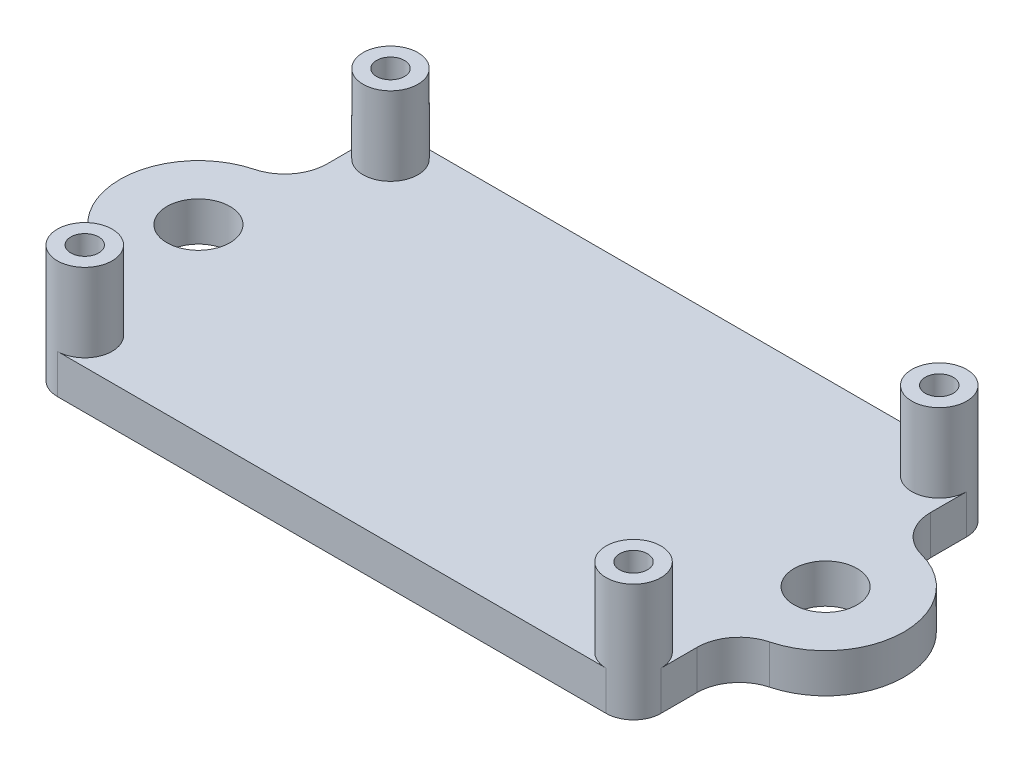
ISO-10303-21;
HEADER;
FILE_DESCRIPTION(('STEP AP214'),'2;1');
FILE_NAME('part.step','',(''),(''),'','','');
FILE_SCHEMA(('AUTOMOTIVE_DESIGN { 1 0 10303 214 1 1 1 1 }'));
ENDSEC;
DATA;
#1=APPLICATION_CONTEXT('core data for automotive mechanical design processes');
#2=APPLICATION_PROTOCOL_DEFINITION('international standard','automotive_design',2000,#1);
#3=PRODUCT_CONTEXT('',#1,'mechanical');
#4=PRODUCT('Part','Part','',(#3));
#5=PRODUCT_RELATED_PRODUCT_CATEGORY('part','',(#4));
#6=PRODUCT_DEFINITION_FORMATION('','',#4);
#7=PRODUCT_DEFINITION_CONTEXT('part definition',#1,'design');
#8=PRODUCT_DEFINITION('design','',#6,#7);
#9=PRODUCT_DEFINITION_SHAPE('','',#8);
#10=(LENGTH_UNIT() NAMED_UNIT(*) SI_UNIT(.MILLI.,.METRE.));
#11=(NAMED_UNIT(*) PLANE_ANGLE_UNIT() SI_UNIT($,.RADIAN.));
#12=(NAMED_UNIT(*) SI_UNIT($,.STERADIAN.) SOLID_ANGLE_UNIT());
#13=UNCERTAINTY_MEASURE_WITH_UNIT(LENGTH_MEASURE(1.E-05),#10,'distance_accuracy_value','');
#14=(GEOMETRIC_REPRESENTATION_CONTEXT(3) GLOBAL_UNCERTAINTY_ASSIGNED_CONTEXT((#13)) GLOBAL_UNIT_ASSIGNED_CONTEXT((#10,
#11,#12)) REPRESENTATION_CONTEXT('',''));
#15=CARTESIAN_POINT('',(0.,0.,0.));
#16=DIRECTION('',(0.,0.,1.));
#17=DIRECTION('',(1.,0.,0.));
#18=AXIS2_PLACEMENT_3D('',#15,#16,#17);
#19=CARTESIAN_POINT('',(24.4475,3.175,-14.605));
#20=DIRECTION('',(-1.,0.,0.));
#21=DIRECTION('',(0.,0.,1.));
#22=AXIS2_PLACEMENT_3D('',#19,#20,#21);
#23=PLANE('',#22);
#24=DIRECTION('',(0.,1.,0.));
#25=VECTOR('',#24,1.);
#26=CARTESIAN_POINT('',(24.4475,0.,-12.3825));
#27=LINE('',#26,#25);
#28=CARTESIAN_POINT('',(24.4475,0.,-12.3825));
#29=VERTEX_POINT('',#28);
#30=CARTESIAN_POINT('',(24.4475,3.175,-12.3825));
#31=VERTEX_POINT('',#30);
#32=EDGE_CURVE('E150',#29,#31,#27,.T.);
#33=ORIENTED_EDGE('',*,*,#32,.T.);
#34=DIRECTION('',(0.,0.,-1.));
#35=VECTOR('',#34,1.);
#36=CARTESIAN_POINT('',(24.4475,3.175,-14.605));
#37=LINE('',#36,#35);
#38=CARTESIAN_POINT('',(24.4475,3.175,-9.46022139011556));
#39=VERTEX_POINT('',#38);
#40=EDGE_CURVE('E254',#39,#31,#37,.T.);
#41=ORIENTED_EDGE('',*,*,#40,.F.);
#42=DIRECTION('',(0.,1.,0.));
#43=VECTOR('',#42,1.);
#44=CARTESIAN_POINT('',(24.4475,0.,-9.46022139011556));
#45=LINE('',#44,#43);
#46=CARTESIAN_POINT('',(24.4475,0.,-9.46022139011556));
#47=VERTEX_POINT('',#46);
#48=EDGE_CURVE('E195',#39,#47,#45,.F.);
#49=ORIENTED_EDGE('',*,*,#48,.T.);
#50=DIRECTION('',(0.,0.,-1.));
#51=VECTOR('',#50,1.);
#52=CARTESIAN_POINT('',(24.4475,0.,-14.605));
#53=LINE('',#52,#51);
#54=EDGE_CURVE('E169',#47,#29,#53,.T.);
#55=ORIENTED_EDGE('',*,*,#54,.T.);
#56=EDGE_LOOP('',(#33,#41,#49,#55));
#57=FACE_BOUND('',#56,.T.);
#58=ADVANCED_FACE('F35',(#57),#23,.F.);
#59=CARTESIAN_POINT('',(-25.4,0.,0.));
#60=DIRECTION('',(0.,1.,0.));
#61=DIRECTION('',(0.,0.,1.));
#62=AXIS2_PLACEMENT_3D('',#59,#60,#61);
#63=PLANE('',#62);
#64=CARTESIAN_POINT('',(22.225,0.,-12.3825));
#65=DIRECTION('',(0.,1.,0.));
#66=DIRECTION('',(0.,0.,1.));
#67=AXIS2_PLACEMENT_3D('',#64,#65,#66);
#68=CIRCLE('',#67,1.1303);
#69=CARTESIAN_POINT('',(22.225,0.,-11.2522));
#70=VERTEX_POINT('',#69);
#71=EDGE_CURVE('E303',#70,#70,#68,.T.);
#72=ORIENTED_EDGE('',*,*,#71,.T.);
#73=EDGE_LOOP('',(#72));
#74=FACE_BOUND('',#73,.T.);
#75=CARTESIAN_POINT('',(-22.225,0.,-12.3825));
#76=DIRECTION('',(0.,1.,0.));
#77=DIRECTION('',(0.,0.,1.));
#78=AXIS2_PLACEMENT_3D('',#75,#76,#77);
#79=CIRCLE('',#78,1.1303);
#80=CARTESIAN_POINT('',(-22.225,0.,-11.2522));
#81=VERTEX_POINT('',#80);
#82=EDGE_CURVE('E309',#81,#81,#79,.T.);
#83=ORIENTED_EDGE('',*,*,#82,.T.);
#84=EDGE_LOOP('',(#83));
#85=FACE_BOUND('',#84,.T.);
#86=CARTESIAN_POINT('',(-22.2249999999999,0.,12.3825));
#87=DIRECTION('',(0.,1.,0.));
#88=DIRECTION('',(0.,0.,1.));
#89=AXIS2_PLACEMENT_3D('',#86,#87,#88);
#90=CIRCLE('',#89,1.1303);
#91=CARTESIAN_POINT('',(-22.2249999999999,0.,13.5128));
#92=VERTEX_POINT('',#91);
#93=EDGE_CURVE('E315',#92,#92,#90,.T.);
#94=ORIENTED_EDGE('',*,*,#93,.T.);
#95=EDGE_LOOP('',(#94));
#96=FACE_BOUND('',#95,.T.);
#97=CARTESIAN_POINT('',(22.225,0.,12.3825));
#98=DIRECTION('',(0.,1.,0.));
#99=DIRECTION('',(0.,0.,1.));
#100=AXIS2_PLACEMENT_3D('',#97,#98,#99);
#101=CIRCLE('',#100,1.1303);
#102=CARTESIAN_POINT('',(22.225,0.,13.5128));
#103=VERTEX_POINT('',#102);
#104=EDGE_CURVE('E321',#103,#103,#101,.T.);
#105=ORIENTED_EDGE('',*,*,#104,.T.);
#106=EDGE_LOOP('',(#105));
#107=FACE_BOUND('',#106,.T.);
#108=CARTESIAN_POINT('',(25.4,0.,0.));
#109=DIRECTION('',(0.,1.,0.));
#110=DIRECTION('',(0.,0.,1.));
#111=AXIS2_PLACEMENT_3D('',#108,#109,#110);
#112=CIRCLE('',#111,2.5527);
#113=CARTESIAN_POINT('',(25.4,0.,2.5527));
#114=VERTEX_POINT('',#113);
#115=EDGE_CURVE('E240',#114,#114,#112,.T.);
#116=ORIENTED_EDGE('',*,*,#115,.T.);
#117=EDGE_LOOP('',(#116));
#118=FACE_BOUND('',#117,.T.);
#119=CARTESIAN_POINT('',(-25.4,0.,0.));
#120=DIRECTION('',(0.,1.,0.));
#121=DIRECTION('',(0.,0.,1.));
#122=AXIS2_PLACEMENT_3D('',#119,#120,#121);
#123=CIRCLE('',#122,2.5527);
#124=CARTESIAN_POINT('',(-25.4,0.,2.5527));
#125=VERTEX_POINT('',#124);
#126=EDGE_CURVE('E246',#125,#125,#123,.T.);
#127=ORIENTED_EDGE('',*,*,#126,.T.);
#128=EDGE_LOOP('',(#127));
#129=FACE_BOUND('',#128,.T.);
#130=DIRECTION('',(-1.,0.,0.));
#131=VECTOR('',#130,1.);
#132=CARTESIAN_POINT('',(-24.4475,0.,-14.605));
#133=LINE('',#132,#131);
#134=CARTESIAN_POINT('',(22.2249999999999,0.,-14.605));
#135=VERTEX_POINT('',#134);
#136=CARTESIAN_POINT('',(-22.2249999999999,0.,-14.605));
#137=VERTEX_POINT('',#136);
#138=EDGE_CURVE('E159',#135,#137,#133,.T.);
#139=ORIENTED_EDGE('',*,*,#138,.F.);
#140=CARTESIAN_POINT('',(22.2249999999999,0.,-12.3825));
#141=DIRECTION('',(0.,-1.,0.));
#142=DIRECTION('',(0.,0.,-1.));
#143=AXIS2_PLACEMENT_3D('',#140,#141,#142);
#144=CIRCLE('',#143,2.22250000000003);
#145=EDGE_CURVE('E148',#135,#29,#144,.T.);
#146=ORIENTED_EDGE('',*,*,#145,.T.);
#147=ORIENTED_EDGE('',*,*,#54,.F.);
#148=CARTESIAN_POINT('',(27.8765,0.,-9.46022139011556));
#149=DIRECTION('',(0.,1.,0.));
#150=DIRECTION('',(0.,0.,1.));
#151=AXIS2_PLACEMENT_3D('',#148,#149,#150);
#152=CIRCLE('',#151,3.429);
#153=CARTESIAN_POINT('',(27.0081168831169,0.,-6.14300090267244));
#154=VERTEX_POINT('',#153);
#155=EDGE_CURVE('E214',#47,#154,#152,.T.);
#156=ORIENTED_EDGE('',*,*,#155,.T.);
#157=CARTESIAN_POINT('',(25.4,0.,0.));
#158=DIRECTION('',(0.,1.,0.));
#159=DIRECTION('',(0.,0.,1.));
#160=AXIS2_PLACEMENT_3D('',#157,#158,#159);
#161=CIRCLE('',#160,6.35);
#162=CARTESIAN_POINT('',(27.0081168831169,0.,6.14300090267244));
#163=VERTEX_POINT('',#162);
#164=EDGE_CURVE('E173',#163,#154,#161,.T.);
#165=ORIENTED_EDGE('',*,*,#164,.F.);
#166=CARTESIAN_POINT('',(27.8765,0.,9.46022139011556));
#167=DIRECTION('',(0.,1.,0.));
#168=DIRECTION('',(0.,0.,1.));
#169=AXIS2_PLACEMENT_3D('',#166,#167,#168);
#170=CIRCLE('',#169,3.429);
#171=CARTESIAN_POINT('',(24.4475,0.,9.46022139011556));
#172=VERTEX_POINT('',#171);
#173=EDGE_CURVE('E222',#163,#172,#170,.T.);
#174=ORIENTED_EDGE('',*,*,#173,.T.);
#175=DIRECTION('',(0.,0.,-1.));
#176=VECTOR('',#175,1.);
#177=CARTESIAN_POINT('',(24.4475,0.,6.27815607881805));
#178=LINE('',#177,#176);
#179=CARTESIAN_POINT('',(24.4475,0.,12.3825));
#180=VERTEX_POINT('',#179);
#181=EDGE_CURVE('E249',#180,#172,#178,.T.);
#182=ORIENTED_EDGE('',*,*,#181,.F.);
#183=CARTESIAN_POINT('',(22.2249999999999,0.,12.3825));
#184=DIRECTION('',(0.,1.,0.));
#185=DIRECTION('',(0.,0.,1.));
#186=AXIS2_PLACEMENT_3D('',#183,#184,#185);
#187=CIRCLE('',#186,2.22250000000003);
#188=CARTESIAN_POINT('',(22.2249999999999,0.,14.605));
#189=VERTEX_POINT('',#188);
#190=EDGE_CURVE('E281',#189,#180,#187,.T.);
#191=ORIENTED_EDGE('',*,*,#190,.F.);
#192=DIRECTION('',(1.,0.,0.));
#193=VECTOR('',#192,1.);
#194=CARTESIAN_POINT('',(-24.4475,0.,14.605));
#195=LINE('',#194,#193);
#196=CARTESIAN_POINT('',(-22.2249999999999,0.,14.605));
#197=VERTEX_POINT('',#196);
#198=EDGE_CURVE('E182',#197,#189,#195,.T.);
#199=ORIENTED_EDGE('',*,*,#198,.F.);
#200=CARTESIAN_POINT('',(-22.2249999999999,0.,12.3825));
#201=DIRECTION('',(0.,-1.,0.));
#202=DIRECTION('',(0.,0.,1.));
#203=AXIS2_PLACEMENT_3D('',#200,#201,#202);
#204=CIRCLE('',#203,2.22250000000003);
#205=CARTESIAN_POINT('',(-24.4475,0.,12.3825));
#206=VERTEX_POINT('',#205);
#207=EDGE_CURVE('E293',#197,#206,#204,.T.);
#208=ORIENTED_EDGE('',*,*,#207,.T.);
#209=DIRECTION('',(0.,0.,1.));
#210=VECTOR('',#209,1.);
#211=CARTESIAN_POINT('',(-24.4475,0.,6.27815607881805));
#212=LINE('',#211,#210);
#213=CARTESIAN_POINT('',(-24.4475,0.,9.46022139011556));
#214=VERTEX_POINT('',#213);
#215=EDGE_CURVE('E179',#214,#206,#212,.T.);
#216=ORIENTED_EDGE('',*,*,#215,.F.);
#217=CARTESIAN_POINT('',(-27.8765,0.,9.46022139011556));
#218=DIRECTION('',(0.,1.,0.));
#219=DIRECTION('',(0.,0.,1.));
#220=AXIS2_PLACEMENT_3D('',#217,#218,#219);
#221=CIRCLE('',#220,3.429);
#222=CARTESIAN_POINT('',(-27.0081168831169,0.,6.14300090267244));
#223=VERTEX_POINT('',#222);
#224=EDGE_CURVE('E218',#214,#223,#221,.T.);
#225=ORIENTED_EDGE('',*,*,#224,.T.);
#226=CARTESIAN_POINT('',(-25.4,0.,0.));
#227=DIRECTION('',(0.,1.,0.));
#228=DIRECTION('',(0.,0.,1.));
#229=AXIS2_PLACEMENT_3D('',#226,#227,#228);
#230=CIRCLE('',#229,6.35);
#231=CARTESIAN_POINT('',(-27.0081168831169,0.,-6.14300090267244));
#232=VERTEX_POINT('',#231);
#233=EDGE_CURVE('E171',#232,#223,#230,.T.);
#234=ORIENTED_EDGE('',*,*,#233,.F.);
#235=CARTESIAN_POINT('',(-27.8765,0.,-9.46022139011556));
#236=DIRECTION('',(0.,1.,0.));
#237=DIRECTION('',(0.,0.,1.));
#238=AXIS2_PLACEMENT_3D('',#235,#236,#237);
#239=CIRCLE('',#238,3.429);
#240=CARTESIAN_POINT('',(-24.4475,0.,-9.46022139011556));
#241=VERTEX_POINT('',#240);
#242=EDGE_CURVE('E209',#232,#241,#239,.T.);
#243=ORIENTED_EDGE('',*,*,#242,.T.);
#244=DIRECTION('',(0.,0.,1.));
#245=VECTOR('',#244,1.);
#246=CARTESIAN_POINT('',(-24.4475,0.,-14.605));
#247=LINE('',#246,#245);
#248=CARTESIAN_POINT('',(-24.4475,0.,-12.3825));
#249=VERTEX_POINT('',#248);
#250=EDGE_CURVE('E168',#249,#241,#247,.T.);
#251=ORIENTED_EDGE('',*,*,#250,.F.);
#252=CARTESIAN_POINT('',(-22.2249999999999,0.,-12.3825));
#253=DIRECTION('',(0.,1.,0.));
#254=DIRECTION('',(0.,0.,-1.));
#255=AXIS2_PLACEMENT_3D('',#252,#253,#254);
#256=CIRCLE('',#255,2.22250000000003);
#257=EDGE_CURVE('E167',#137,#249,#256,.T.);
#258=ORIENTED_EDGE('',*,*,#257,.F.);
#259=EDGE_LOOP('',(#139,#146,#147,#156,#165,#174,#182,#191,#199,#208,#216,#225,#234,#243,#251,#258));
#260=FACE_BOUND('',#259,.T.);
#261=ADVANCED_FACE('F165',(#74,#85,#96,#107,#118,#129,#260),#63,.F.);
#262=CARTESIAN_POINT('',(24.4475,3.175,6.27815607881805));
#263=DIRECTION('',(-1.,0.,0.));
#264=DIRECTION('',(0.,0.,1.));
#265=AXIS2_PLACEMENT_3D('',#262,#263,#264);
#266=PLANE('',#265);
#267=DIRECTION('',(0.,1.,0.));
#268=VECTOR('',#267,1.);
#269=CARTESIAN_POINT('',(24.4475,0.,12.3825));
#270=LINE('',#269,#268);
#271=CARTESIAN_POINT('',(24.4475,3.175,12.3825));
#272=VERTEX_POINT('',#271);
#273=EDGE_CURVE('E283',#180,#272,#270,.T.);
#274=ORIENTED_EDGE('',*,*,#273,.F.);
#275=ORIENTED_EDGE('',*,*,#181,.T.);
#276=DIRECTION('',(0.,1.,0.));
#277=VECTOR('',#276,1.);
#278=CARTESIAN_POINT('',(24.4475,3.175,9.46022139011556));
#279=LINE('',#278,#277);
#280=CARTESIAN_POINT('',(24.4475,3.175,9.46022139011556));
#281=VERTEX_POINT('',#280);
#282=EDGE_CURVE('E206',#172,#281,#279,.T.);
#283=ORIENTED_EDGE('',*,*,#282,.T.);
#284=DIRECTION('',(0.,0.,-1.));
#285=VECTOR('',#284,1.);
#286=CARTESIAN_POINT('',(24.4475,3.175,6.27815607881805));
#287=LINE('',#286,#285);
#288=EDGE_CURVE('E185',#272,#281,#287,.T.);
#289=ORIENTED_EDGE('',*,*,#288,.F.);
#290=EDGE_LOOP('',(#274,#275,#283,#289));
#291=FACE_BOUND('',#290,.T.);
#292=ADVANCED_FACE('F360',(#291),#266,.F.);
#293=CARTESIAN_POINT('',(-24.4475,3.175,-14.605));
#294=DIRECTION('',(1.,0.,0.));
#295=DIRECTION('',(0.,0.,-1.));
#296=AXIS2_PLACEMENT_3D('',#293,#294,#295);
#297=PLANE('',#296);
#298=DIRECTION('',(0.,1.,0.));
#299=VECTOR('',#298,1.);
#300=CARTESIAN_POINT('',(-24.4475,0.,-12.3825));
#301=LINE('',#300,#299);
#302=CARTESIAN_POINT('',(-24.4475,3.175,-12.3825));
#303=VERTEX_POINT('',#302);
#304=EDGE_CURVE('E290',#249,#303,#301,.T.);
#305=ORIENTED_EDGE('',*,*,#304,.F.);
#306=ORIENTED_EDGE('',*,*,#250,.T.);
#307=DIRECTION('',(0.,1.,0.));
#308=VECTOR('',#307,1.);
#309=CARTESIAN_POINT('',(-24.4475,3.175,-9.46022139011556));
#310=LINE('',#309,#308);
#311=CARTESIAN_POINT('',(-24.4475,3.175,-9.46022139011556));
#312=VERTEX_POINT('',#311);
#313=EDGE_CURVE('E192',#241,#312,#310,.T.);
#314=ORIENTED_EDGE('',*,*,#313,.T.);
#315=DIRECTION('',(0.,0.,1.));
#316=VECTOR('',#315,1.);
#317=CARTESIAN_POINT('',(-24.4475,3.175,-14.605));
#318=LINE('',#317,#316);
#319=EDGE_CURVE('E257',#303,#312,#318,.T.);
#320=ORIENTED_EDGE('',*,*,#319,.F.);
#321=EDGE_LOOP('',(#305,#306,#314,#320));
#322=FACE_BOUND('',#321,.T.);
#323=ADVANCED_FACE('F370',(#322),#297,.F.);
#324=CARTESIAN_POINT('',(-24.4475,3.175,6.27815607881805));
#325=DIRECTION('',(1.,0.,0.));
#326=DIRECTION('',(0.,0.,-1.));
#327=AXIS2_PLACEMENT_3D('',#324,#325,#326);
#328=PLANE('',#327);
#329=DIRECTION('',(0.,1.,0.));
#330=VECTOR('',#329,1.);
#331=CARTESIAN_POINT('',(-24.4475,0.,12.3825));
#332=LINE('',#331,#330);
#333=CARTESIAN_POINT('',(-24.4475,3.175,12.3825));
#334=VERTEX_POINT('',#333);
#335=EDGE_CURVE('E297',#206,#334,#332,.T.);
#336=ORIENTED_EDGE('',*,*,#335,.T.);
#337=DIRECTION('',(0.,0.,1.));
#338=VECTOR('',#337,1.);
#339=CARTESIAN_POINT('',(-24.4475,3.175,6.27815607881805));
#340=LINE('',#339,#338);
#341=CARTESIAN_POINT('',(-24.4475,3.175,9.46022139011556));
#342=VERTEX_POINT('',#341);
#343=EDGE_CURVE('E262',#342,#334,#340,.T.);
#344=ORIENTED_EDGE('',*,*,#343,.F.);
#345=DIRECTION('',(0.,1.,0.));
#346=VECTOR('',#345,1.);
#347=CARTESIAN_POINT('',(-24.4475,0.,9.46022139011556));
#348=LINE('',#347,#346);
#349=EDGE_CURVE('E203',#342,#214,#348,.F.);
#350=ORIENTED_EDGE('',*,*,#349,.T.);
#351=ORIENTED_EDGE('',*,*,#215,.T.);
#352=EDGE_LOOP('',(#336,#344,#350,#351));
#353=FACE_BOUND('',#352,.T.);
#354=ADVANCED_FACE('F391',(#353),#328,.F.);
#355=CARTESIAN_POINT('',(-25.4,3.175,0.));
#356=DIRECTION('',(0.,1.,0.));
#357=DIRECTION('',(0.,0.,1.));
#358=AXIS2_PLACEMENT_3D('',#355,#356,#357);
#359=PLANE('',#358);
#360=CARTESIAN_POINT('',(-25.4,3.175,0.));
#361=DIRECTION('',(0.,1.,0.));
#362=DIRECTION('',(0.,0.,1.));
#363=AXIS2_PLACEMENT_3D('',#360,#361,#362);
#364=CIRCLE('',#363,2.5527);
#365=CARTESIAN_POINT('',(-25.4,3.175,2.5527));
#366=VERTEX_POINT('',#365);
#367=EDGE_CURVE('E243',#366,#366,#364,.T.);
#368=ORIENTED_EDGE('',*,*,#367,.F.);
#369=EDGE_LOOP('',(#368));
#370=FACE_BOUND('',#369,.T.);
#371=CARTESIAN_POINT('',(25.4,3.175,0.));
#372=DIRECTION('',(0.,1.,0.));
#373=DIRECTION('',(0.,0.,1.));
#374=AXIS2_PLACEMENT_3D('',#371,#372,#373);
#375=CIRCLE('',#374,2.5527);
#376=CARTESIAN_POINT('',(25.4,3.175,2.5527));
#377=VERTEX_POINT('',#376);
#378=EDGE_CURVE('E237',#377,#377,#375,.T.);
#379=ORIENTED_EDGE('',*,*,#378,.F.);
#380=EDGE_LOOP('',(#379));
#381=FACE_BOUND('',#380,.T.);
#382=ORIENTED_EDGE('',*,*,#343,.T.);
#383=CARTESIAN_POINT('',(-22.2249999999999,3.175,12.3825));
#384=DIRECTION('',(0.,1.,0.));
#385=DIRECTION('',(0.,0.,1.));
#386=AXIS2_PLACEMENT_3D('',#383,#384,#385);
#387=CIRCLE('',#386,2.22249999999999);
#388=CARTESIAN_POINT('',(-22.2249999999999,3.175,14.605));
#389=VERTEX_POINT('',#388);
#390=EDGE_CURVE('E324',#389,#334,#387,.T.);
#391=ORIENTED_EDGE('',*,*,#390,.F.);
#392=DIRECTION('',(1.,0.,0.));
#393=VECTOR('',#392,1.);
#394=CARTESIAN_POINT('',(-24.4475,3.175,14.605));
#395=LINE('',#394,#393);
#396=CARTESIAN_POINT('',(22.2249999999999,3.175,14.605));
#397=VERTEX_POINT('',#396);
#398=EDGE_CURVE('E189',#389,#397,#395,.T.);
#399=ORIENTED_EDGE('',*,*,#398,.T.);
#400=CARTESIAN_POINT('',(22.225,3.175,12.3825));
#401=DIRECTION('',(0.,1.,0.));
#402=DIRECTION('',(0.,0.,1.));
#403=AXIS2_PLACEMENT_3D('',#400,#401,#402);
#404=CIRCLE('',#403,2.22249999999999);
#405=EDGE_CURVE('E11',#397,#272,#404,.F.);
#406=ORIENTED_EDGE('',*,*,#405,.T.);
#407=ORIENTED_EDGE('',*,*,#288,.T.);
#408=CARTESIAN_POINT('',(27.8765,3.175,9.46022139011556));
#409=DIRECTION('',(0.,1.,0.));
#410=DIRECTION('',(0.,0.,1.));
#411=AXIS2_PLACEMENT_3D('',#408,#409,#410);
#412=CIRCLE('',#411,3.429);
#413=CARTESIAN_POINT('',(27.0081168831169,3.175,6.14300090267244));
#414=VERTEX_POINT('',#413);
#415=EDGE_CURVE('E225',#281,#414,#412,.F.);
#416=ORIENTED_EDGE('',*,*,#415,.T.);
#417=CARTESIAN_POINT('',(25.4,3.175,0.));
#418=DIRECTION('',(0.,1.,0.));
#419=DIRECTION('',(0.,0.,1.));
#420=AXIS2_PLACEMENT_3D('',#417,#418,#419);
#421=CIRCLE('',#420,6.35);
#422=CARTESIAN_POINT('',(27.0081168831169,3.175,-6.14300090267244));
#423=VERTEX_POINT('',#422);
#424=EDGE_CURVE('E251',#414,#423,#421,.T.);
#425=ORIENTED_EDGE('',*,*,#424,.T.);
#426=CARTESIAN_POINT('',(27.8765,3.175,-9.46022139011556));
#427=DIRECTION('',(0.,1.,0.));
#428=DIRECTION('',(0.,0.,1.));
#429=AXIS2_PLACEMENT_3D('',#426,#427,#428);
#430=CIRCLE('',#429,3.429);
#431=EDGE_CURVE('E216',#423,#39,#430,.F.);
#432=ORIENTED_EDGE('',*,*,#431,.T.);
#433=ORIENTED_EDGE('',*,*,#40,.T.);
#434=CARTESIAN_POINT('',(22.225,3.175,-12.3825));
#435=DIRECTION('',(0.,1.,0.));
#436=DIRECTION('',(0.,0.,1.));
#437=AXIS2_PLACEMENT_3D('',#434,#435,#436);
#438=CIRCLE('',#437,2.22249999999999);
#439=CARTESIAN_POINT('',(22.225,3.175,-14.605));
#440=VERTEX_POINT('',#439);
#441=EDGE_CURVE('E43',#31,#440,#438,.F.);
#442=ORIENTED_EDGE('',*,*,#441,.T.);
#443=DIRECTION('',(-1.,0.,0.));
#444=VECTOR('',#443,1.);
#445=CARTESIAN_POINT('',(-24.4475,3.175,-14.605));
#446=LINE('',#445,#444);
#447=CARTESIAN_POINT('',(-22.2249999999999,3.175,-14.605));
#448=VERTEX_POINT('',#447);
#449=EDGE_CURVE('E162',#440,#448,#446,.T.);
#450=ORIENTED_EDGE('',*,*,#449,.T.);
#451=CARTESIAN_POINT('',(-22.225,3.175,-12.3825));
#452=DIRECTION('',(0.,1.,0.));
#453=DIRECTION('',(0.,0.,1.));
#454=AXIS2_PLACEMENT_3D('',#451,#452,#453);
#455=CIRCLE('',#454,2.22249999999999);
#456=EDGE_CURVE('E226',#303,#448,#455,.T.);
#457=ORIENTED_EDGE('',*,*,#456,.F.);
#458=ORIENTED_EDGE('',*,*,#319,.T.);
#459=CARTESIAN_POINT('',(-27.8765,3.175,-9.46022139011556));
#460=DIRECTION('',(0.,1.,0.));
#461=DIRECTION('',(0.,0.,1.));
#462=AXIS2_PLACEMENT_3D('',#459,#460,#461);
#463=CIRCLE('',#462,3.429);
#464=CARTESIAN_POINT('',(-27.0081168831169,3.175,-6.14300090267244));
#465=VERTEX_POINT('',#464);
#466=EDGE_CURVE('E212',#312,#465,#463,.F.);
#467=ORIENTED_EDGE('',*,*,#466,.T.);
#468=CARTESIAN_POINT('',(-25.4,3.175,0.));
#469=DIRECTION('',(0.,1.,0.));
#470=DIRECTION('',(0.,0.,1.));
#471=AXIS2_PLACEMENT_3D('',#468,#469,#470);
#472=CIRCLE('',#471,6.35);
#473=CARTESIAN_POINT('',(-27.0081168831169,3.175,6.14300090267244));
#474=VERTEX_POINT('',#473);
#475=EDGE_CURVE('E259',#465,#474,#472,.T.);
#476=ORIENTED_EDGE('',*,*,#475,.T.);
#477=CARTESIAN_POINT('',(-27.8765,3.175,9.46022139011556));
#478=DIRECTION('',(0.,1.,0.));
#479=DIRECTION('',(0.,0.,1.));
#480=AXIS2_PLACEMENT_3D('',#477,#478,#479);
#481=CIRCLE('',#480,3.429);
#482=EDGE_CURVE('E220',#474,#342,#481,.F.);
#483=ORIENTED_EDGE('',*,*,#482,.T.);
#484=EDGE_LOOP('',(#382,#391,#399,#406,#407,#416,#425,#432,#433,#442,#450,#457,#458,#467,#476,#483));
#485=FACE_BOUND('',#484,.T.);
#486=ADVANCED_FACE('F279',(#370,#381,#485),#359,.T.);
#487=CARTESIAN_POINT('',(25.4,3.175,0.));
#488=DIRECTION('',(0.,-1.,0.));
#489=DIRECTION('',(0.,0.,-1.));
#490=AXIS2_PLACEMENT_3D('',#487,#488,#489);
#491=CYLINDRICAL_SURFACE('',#490,6.35);
#492=ORIENTED_EDGE('',*,*,#164,.T.);
#493=DIRECTION('',(0.,-1.,0.));
#494=VECTOR('',#493,1.);
#495=CARTESIAN_POINT('',(27.0081168831169,3.175,-6.14300090267244));
#496=LINE('',#495,#494);
#497=EDGE_CURVE('E201',#154,#423,#496,.F.);
#498=ORIENTED_EDGE('',*,*,#497,.T.);
#499=ORIENTED_EDGE('',*,*,#424,.F.);
#500=DIRECTION('',(0.,-1.,0.));
#501=VECTOR('',#500,1.);
#502=CARTESIAN_POINT('',(27.0081168831169,3.175,6.14300090267244));
#503=LINE('',#502,#501);
#504=EDGE_CURVE('E198',#414,#163,#503,.T.);
#505=ORIENTED_EDGE('',*,*,#504,.T.);
#506=EDGE_LOOP('',(#492,#498,#499,#505));
#507=FACE_BOUND('',#506,.T.);
#508=ADVANCED_FACE('F271',(#507),#491,.T.);
#509=CARTESIAN_POINT('',(-24.4475,3.175,-14.605));
#510=DIRECTION('',(0.,0.,1.));
#511=DIRECTION('',(1.,0.,0.));
#512=AXIS2_PLACEMENT_3D('',#509,#510,#511);
#513=PLANE('',#512);
#514=ORIENTED_EDGE('',*,*,#449,.F.);
#515=DIRECTION('',(0.,1.,0.));
#516=VECTOR('',#515,1.);
#517=CARTESIAN_POINT('',(22.2249999999999,0.,-14.605));
#518=LINE('',#517,#516);
#519=EDGE_CURVE('E58',#135,#440,#518,.T.);
#520=ORIENTED_EDGE('',*,*,#519,.F.);
#521=ORIENTED_EDGE('',*,*,#138,.T.);
#522=DIRECTION('',(0.,1.,0.));
#523=VECTOR('',#522,1.);
#524=CARTESIAN_POINT('',(-22.2249999999999,0.,-14.605));
#525=LINE('',#524,#523);
#526=EDGE_CURVE('E291',#137,#448,#525,.T.);
#527=ORIENTED_EDGE('',*,*,#526,.T.);
#528=EDGE_LOOP('',(#514,#520,#521,#527));
#529=FACE_BOUND('',#528,.T.);
#530=ADVANCED_FACE('F158',(#529),#513,.F.);
#531=CARTESIAN_POINT('',(-25.4,3.175,0.));
#532=DIRECTION('',(0.,-1.,0.));
#533=DIRECTION('',(0.,0.,-1.));
#534=AXIS2_PLACEMENT_3D('',#531,#532,#533);
#535=CYLINDRICAL_SURFACE('',#534,6.35);
#536=ORIENTED_EDGE('',*,*,#475,.F.);
#537=DIRECTION('',(0.,-1.,0.));
#538=VECTOR('',#537,1.);
#539=CARTESIAN_POINT('',(-27.0081168831169,3.175,-6.14300090267244));
#540=LINE('',#539,#538);
#541=EDGE_CURVE('E188',#465,#232,#540,.T.);
#542=ORIENTED_EDGE('',*,*,#541,.T.);
#543=ORIENTED_EDGE('',*,*,#233,.T.);
#544=DIRECTION('',(0.,-1.,0.));
#545=VECTOR('',#544,1.);
#546=CARTESIAN_POINT('',(-27.0081168831169,3.175,6.14300090267244));
#547=LINE('',#546,#545);
#548=EDGE_CURVE('E186',#223,#474,#547,.F.);
#549=ORIENTED_EDGE('',*,*,#548,.T.);
#550=EDGE_LOOP('',(#536,#542,#543,#549));
#551=FACE_BOUND('',#550,.T.);
#552=ADVANCED_FACE('F408',(#551),#535,.T.);
#553=CARTESIAN_POINT('',(-24.4475,3.175,14.605));
#554=DIRECTION('',(0.,0.,-1.));
#555=DIRECTION('',(-1.,0.,0.));
#556=AXIS2_PLACEMENT_3D('',#553,#554,#555);
#557=PLANE('',#556);
#558=ORIENTED_EDGE('',*,*,#198,.T.);
#559=DIRECTION('',(0.,1.,0.));
#560=VECTOR('',#559,1.);
#561=CARTESIAN_POINT('',(22.2249999999999,0.,14.605));
#562=LINE('',#561,#560);
#563=EDGE_CURVE('E286',#189,#397,#562,.T.);
#564=ORIENTED_EDGE('',*,*,#563,.T.);
#565=ORIENTED_EDGE('',*,*,#398,.F.);
#566=DIRECTION('',(0.,1.,0.));
#567=VECTOR('',#566,1.);
#568=CARTESIAN_POINT('',(-22.2249999999999,0.,14.605));
#569=LINE('',#568,#567);
#570=EDGE_CURVE('E50',#197,#389,#569,.T.);
#571=ORIENTED_EDGE('',*,*,#570,.F.);
#572=EDGE_LOOP('',(#558,#564,#565,#571));
#573=FACE_BOUND('',#572,.T.);
#574=ADVANCED_FACE('F375',(#573),#557,.F.);
#575=CARTESIAN_POINT('',(-27.8765,3.175,-9.46022139011556));
#576=DIRECTION('',(0.,-1.,0.));
#577=DIRECTION('',(0.,0.,-1.));
#578=AXIS2_PLACEMENT_3D('',#575,#576,#577);
#579=CYLINDRICAL_SURFACE('',#578,3.429);
#580=ORIENTED_EDGE('',*,*,#466,.F.);
#581=ORIENTED_EDGE('',*,*,#313,.F.);
#582=ORIENTED_EDGE('',*,*,#242,.F.);
#583=ORIENTED_EDGE('',*,*,#541,.F.);
#584=EDGE_LOOP('',(#580,#581,#582,#583));
#585=FACE_BOUND('',#584,.T.);
#586=ADVANCED_FACE('F372',(#585),#579,.F.);
#587=CARTESIAN_POINT('',(27.8765,3.175,-9.46022139011556));
#588=DIRECTION('',(0.,-1.,0.));
#589=DIRECTION('',(0.,0.,-1.));
#590=AXIS2_PLACEMENT_3D('',#587,#588,#589);
#591=CYLINDRICAL_SURFACE('',#590,3.429);
#592=ORIENTED_EDGE('',*,*,#431,.F.);
#593=ORIENTED_EDGE('',*,*,#497,.F.);
#594=ORIENTED_EDGE('',*,*,#155,.F.);
#595=ORIENTED_EDGE('',*,*,#48,.F.);
#596=EDGE_LOOP('',(#592,#593,#594,#595));
#597=FACE_BOUND('',#596,.T.);
#598=ADVANCED_FACE('F276',(#597),#591,.F.);
#599=CARTESIAN_POINT('',(-27.8765,3.175,9.46022139011556));
#600=DIRECTION('',(0.,-1.,0.));
#601=DIRECTION('',(0.,0.,-1.));
#602=AXIS2_PLACEMENT_3D('',#599,#600,#601);
#603=CYLINDRICAL_SURFACE('',#602,3.429);
#604=ORIENTED_EDGE('',*,*,#482,.F.);
#605=ORIENTED_EDGE('',*,*,#548,.F.);
#606=ORIENTED_EDGE('',*,*,#224,.F.);
#607=ORIENTED_EDGE('',*,*,#349,.F.);
#608=EDGE_LOOP('',(#604,#605,#606,#607));
#609=FACE_BOUND('',#608,.T.);
#610=ADVANCED_FACE('F378',(#609),#603,.F.);
#611=CARTESIAN_POINT('',(27.8765,3.175,9.46022139011556));
#612=DIRECTION('',(0.,-1.,0.));
#613=DIRECTION('',(0.,0.,-1.));
#614=AXIS2_PLACEMENT_3D('',#611,#612,#613);
#615=CYLINDRICAL_SURFACE('',#614,3.429);
#616=ORIENTED_EDGE('',*,*,#415,.F.);
#617=ORIENTED_EDGE('',*,*,#282,.F.);
#618=ORIENTED_EDGE('',*,*,#173,.F.);
#619=ORIENTED_EDGE('',*,*,#504,.F.);
#620=EDGE_LOOP('',(#616,#617,#618,#619));
#621=FACE_BOUND('',#620,.T.);
#622=ADVANCED_FACE('F37',(#621),#615,.F.);
#623=CARTESIAN_POINT('',(-25.4,3.175,0.));
#624=DIRECTION('',(0.,1.,0.));
#625=DIRECTION('',(0.,0.,1.));
#626=AXIS2_PLACEMENT_3D('',#623,#624,#625);
#627=CYLINDRICAL_SURFACE('',#626,2.5527);
#628=ORIENTED_EDGE('',*,*,#126,.F.);
#629=EDGE_LOOP('',(#628));
#630=FACE_BOUND('',#629,.T.);
#631=ORIENTED_EDGE('',*,*,#367,.T.);
#632=EDGE_LOOP('',(#631));
#633=FACE_BOUND('',#632,.T.);
#634=ADVANCED_FACE('F352',(#630,#633),#627,.F.);
#635=CARTESIAN_POINT('',(25.4,3.175,0.));
#636=DIRECTION('',(0.,1.,0.));
#637=DIRECTION('',(0.,0.,1.));
#638=AXIS2_PLACEMENT_3D('',#635,#636,#637);
#639=CYLINDRICAL_SURFACE('',#638,2.5527);
#640=ORIENTED_EDGE('',*,*,#115,.F.);
#641=EDGE_LOOP('',(#640));
#642=FACE_BOUND('',#641,.T.);
#643=ORIENTED_EDGE('',*,*,#378,.T.);
#644=EDGE_LOOP('',(#643));
#645=FACE_BOUND('',#644,.T.);
#646=ADVANCED_FACE('F342',(#642,#645),#639,.F.);
#647=CARTESIAN_POINT('',(-22.225,9.525,-12.3825));
#648=DIRECTION('',(0.,-1.,0.));
#649=DIRECTION('',(0.,0.,-1.));
#650=AXIS2_PLACEMENT_3D('',#647,#648,#649);
#651=CYLINDRICAL_SURFACE('',#650,2.22249999999999);
#652=CARTESIAN_POINT('',(-22.225,9.525,-12.3825));
#653=DIRECTION('',(0.,1.,0.));
#654=DIRECTION('',(0.,0.,1.));
#655=AXIS2_PLACEMENT_3D('',#652,#653,#654);
#656=CIRCLE('',#655,2.22249999999999);
#657=CARTESIAN_POINT('',(-22.225,9.525,-10.16));
#658=VERTEX_POINT('',#657);
#659=EDGE_CURVE('E235',#658,#658,#656,.T.);
#660=ORIENTED_EDGE('',*,*,#659,.F.);
#661=EDGE_LOOP('',(#660));
#662=FACE_BOUND('',#661,.T.);
#663=ORIENTED_EDGE('',*,*,#456,.T.);
#664=ORIENTED_EDGE('',*,*,#526,.F.);
#665=ORIENTED_EDGE('',*,*,#257,.T.);
#666=ORIENTED_EDGE('',*,*,#304,.T.);
#667=EDGE_LOOP('',(#663,#664,#665,#666));
#668=FACE_BOUND('',#667,.T.);
#669=ADVANCED_FACE('F340',(#662,#668),#651,.T.);
#670=CARTESIAN_POINT('',(-22.225,9.525,-12.3825));
#671=DIRECTION('',(0.,1.,0.));
#672=DIRECTION('',(0.,0.,1.));
#673=AXIS2_PLACEMENT_3D('',#670,#671,#672);
#674=PLANE('',#673);
#675=CARTESIAN_POINT('',(-22.225,9.525,-12.3825));
#676=DIRECTION('',(0.,1.,0.));
#677=DIRECTION('',(0.,0.,1.));
#678=AXIS2_PLACEMENT_3D('',#675,#676,#677);
#679=CIRCLE('',#678,1.1303);
#680=CARTESIAN_POINT('',(-22.225,9.525,-11.2522));
#681=VERTEX_POINT('',#680);
#682=EDGE_CURVE('E306',#681,#681,#679,.T.);
#683=ORIENTED_EDGE('',*,*,#682,.F.);
#684=EDGE_LOOP('',(#683));
#685=FACE_BOUND('',#684,.T.);
#686=ORIENTED_EDGE('',*,*,#659,.T.);
#687=EDGE_LOOP('',(#686));
#688=FACE_BOUND('',#687,.T.);
#689=ADVANCED_FACE('F338',(#685,#688),#674,.T.);
#690=CARTESIAN_POINT('',(22.225,9.525,-12.3825));
#691=DIRECTION('',(0.,-1.,0.));
#692=DIRECTION('',(0.,0.,-1.));
#693=AXIS2_PLACEMENT_3D('',#690,#691,#692);
#694=CYLINDRICAL_SURFACE('',#693,2.22249999999999);
#695=CARTESIAN_POINT('',(22.225,9.525,-12.3825));
#696=DIRECTION('',(0.,1.,0.));
#697=DIRECTION('',(0.,0.,1.));
#698=AXIS2_PLACEMENT_3D('',#695,#696,#697);
#699=CIRCLE('',#698,2.22249999999999);
#700=CARTESIAN_POINT('',(22.225,9.525,-10.16));
#701=VERTEX_POINT('',#700);
#702=EDGE_CURVE('E331',#701,#701,#699,.T.);
#703=ORIENTED_EDGE('',*,*,#702,.F.);
#704=EDGE_LOOP('',(#703));
#705=FACE_BOUND('',#704,.T.);
#706=ORIENTED_EDGE('',*,*,#441,.F.);
#707=ORIENTED_EDGE('',*,*,#32,.F.);
#708=ORIENTED_EDGE('',*,*,#145,.F.);
#709=ORIENTED_EDGE('',*,*,#519,.T.);
#710=EDGE_LOOP('',(#706,#707,#708,#709));
#711=FACE_BOUND('',#710,.T.);
#712=ADVANCED_FACE('F149',(#705,#711),#694,.T.);
#713=CARTESIAN_POINT('',(22.225,9.525,-12.3825));
#714=DIRECTION('',(0.,1.,0.));
#715=DIRECTION('',(0.,0.,1.));
#716=AXIS2_PLACEMENT_3D('',#713,#714,#715);
#717=PLANE('',#716);
#718=CARTESIAN_POINT('',(22.225,9.525,-12.3825));
#719=DIRECTION('',(0.,1.,0.));
#720=DIRECTION('',(0.,0.,1.));
#721=AXIS2_PLACEMENT_3D('',#718,#719,#720);
#722=CIRCLE('',#721,1.1303);
#723=CARTESIAN_POINT('',(22.225,9.525,-11.2522));
#724=VERTEX_POINT('',#723);
#725=EDGE_CURVE('E299',#724,#724,#722,.T.);
#726=ORIENTED_EDGE('',*,*,#725,.F.);
#727=EDGE_LOOP('',(#726));
#728=FACE_BOUND('',#727,.T.);
#729=ORIENTED_EDGE('',*,*,#702,.T.);
#730=EDGE_LOOP('',(#729));
#731=FACE_BOUND('',#730,.T.);
#732=ADVANCED_FACE('F454',(#728,#731),#717,.T.);
#733=CARTESIAN_POINT('',(22.225,9.525,12.3825));
#734=DIRECTION('',(0.,-1.,0.));
#735=DIRECTION('',(0.,0.,-1.));
#736=AXIS2_PLACEMENT_3D('',#733,#734,#735);
#737=CYLINDRICAL_SURFACE('',#736,2.22249999999999);
#738=CARTESIAN_POINT('',(22.225,9.525,12.3825));
#739=DIRECTION('',(0.,1.,0.));
#740=DIRECTION('',(0.,0.,1.));
#741=AXIS2_PLACEMENT_3D('',#738,#739,#740);
#742=CIRCLE('',#741,2.22249999999999);
#743=CARTESIAN_POINT('',(22.225,9.525,14.605));
#744=VERTEX_POINT('',#743);
#745=EDGE_CURVE('E328',#744,#744,#742,.T.);
#746=ORIENTED_EDGE('',*,*,#745,.F.);
#747=EDGE_LOOP('',(#746));
#748=FACE_BOUND('',#747,.T.);
#749=ORIENTED_EDGE('',*,*,#405,.F.);
#750=ORIENTED_EDGE('',*,*,#563,.F.);
#751=ORIENTED_EDGE('',*,*,#190,.T.);
#752=ORIENTED_EDGE('',*,*,#273,.T.);
#753=EDGE_LOOP('',(#749,#750,#751,#752));
#754=FACE_BOUND('',#753,.T.);
#755=ADVANCED_FACE('F400',(#748,#754),#737,.T.);
#756=CARTESIAN_POINT('',(22.225,9.525,12.3825));
#757=DIRECTION('',(0.,1.,0.));
#758=DIRECTION('',(0.,0.,1.));
#759=AXIS2_PLACEMENT_3D('',#756,#757,#758);
#760=PLANE('',#759);
#761=CARTESIAN_POINT('',(22.225,9.525,12.3825));
#762=DIRECTION('',(0.,1.,0.));
#763=DIRECTION('',(0.,0.,1.));
#764=AXIS2_PLACEMENT_3D('',#761,#762,#763);
#765=CIRCLE('',#764,1.1303);
#766=CARTESIAN_POINT('',(22.225,9.525,13.5128));
#767=VERTEX_POINT('',#766);
#768=EDGE_CURVE('E318',#767,#767,#765,.T.);
#769=ORIENTED_EDGE('',*,*,#768,.F.);
#770=EDGE_LOOP('',(#769));
#771=FACE_BOUND('',#770,.T.);
#772=ORIENTED_EDGE('',*,*,#745,.T.);
#773=EDGE_LOOP('',(#772));
#774=FACE_BOUND('',#773,.T.);
#775=ADVANCED_FACE('F462',(#771,#774),#760,.T.);
#776=CARTESIAN_POINT('',(-22.2249999999999,9.525,12.3825));
#777=DIRECTION('',(0.,-1.,0.));
#778=DIRECTION('',(0.,0.,-1.));
#779=AXIS2_PLACEMENT_3D('',#776,#777,#778);
#780=CYLINDRICAL_SURFACE('',#779,2.22249999999999);
#781=CARTESIAN_POINT('',(-22.2249999999999,9.525,12.3825));
#782=DIRECTION('',(0.,1.,0.));
#783=DIRECTION('',(0.,0.,1.));
#784=AXIS2_PLACEMENT_3D('',#781,#782,#783);
#785=CIRCLE('',#784,2.22249999999999);
#786=CARTESIAN_POINT('',(-22.2249999999999,9.525,14.605));
#787=VERTEX_POINT('',#786);
#788=EDGE_CURVE('E325',#787,#787,#785,.T.);
#789=ORIENTED_EDGE('',*,*,#788,.F.);
#790=EDGE_LOOP('',(#789));
#791=FACE_BOUND('',#790,.T.);
#792=ORIENTED_EDGE('',*,*,#390,.T.);
#793=ORIENTED_EDGE('',*,*,#335,.F.);
#794=ORIENTED_EDGE('',*,*,#207,.F.);
#795=ORIENTED_EDGE('',*,*,#570,.T.);
#796=EDGE_LOOP('',(#792,#793,#794,#795));
#797=FACE_BOUND('',#796,.T.);
#798=ADVANCED_FACE('F393',(#791,#797),#780,.T.);
#799=CARTESIAN_POINT('',(-22.2249999999999,9.525,12.3825));
#800=DIRECTION('',(0.,1.,0.));
#801=DIRECTION('',(0.,0.,1.));
#802=AXIS2_PLACEMENT_3D('',#799,#800,#801);
#803=PLANE('',#802);
#804=CARTESIAN_POINT('',(-22.2249999999999,9.525,12.3825));
#805=DIRECTION('',(0.,1.,0.));
#806=DIRECTION('',(0.,0.,1.));
#807=AXIS2_PLACEMENT_3D('',#804,#805,#806);
#808=CIRCLE('',#807,1.1303);
#809=CARTESIAN_POINT('',(-22.2249999999999,9.525,13.5128));
#810=VERTEX_POINT('',#809);
#811=EDGE_CURVE('E312',#810,#810,#808,.T.);
#812=ORIENTED_EDGE('',*,*,#811,.F.);
#813=EDGE_LOOP('',(#812));
#814=FACE_BOUND('',#813,.T.);
#815=ORIENTED_EDGE('',*,*,#788,.T.);
#816=EDGE_LOOP('',(#815));
#817=FACE_BOUND('',#816,.T.);
#818=ADVANCED_FACE('F470',(#814,#817),#803,.T.);
#819=CARTESIAN_POINT('',(22.225,9.525,12.3825));
#820=DIRECTION('',(0.,1.,0.));
#821=DIRECTION('',(0.,0.,1.));
#822=AXIS2_PLACEMENT_3D('',#819,#820,#821);
#823=CYLINDRICAL_SURFACE('',#822,1.1303);
#824=ORIENTED_EDGE('',*,*,#104,.F.);
#825=EDGE_LOOP('',(#824));
#826=FACE_BOUND('',#825,.T.);
#827=ORIENTED_EDGE('',*,*,#768,.T.);
#828=EDGE_LOOP('',(#827));
#829=FACE_BOUND('',#828,.T.);
#830=ADVANCED_FACE('F473',(#826,#829),#823,.F.);
#831=CARTESIAN_POINT('',(-22.2249999999999,9.525,12.3825));
#832=DIRECTION('',(0.,1.,0.));
#833=DIRECTION('',(0.,0.,1.));
#834=AXIS2_PLACEMENT_3D('',#831,#832,#833);
#835=CYLINDRICAL_SURFACE('',#834,1.1303);
#836=ORIENTED_EDGE('',*,*,#93,.F.);
#837=EDGE_LOOP('',(#836));
#838=FACE_BOUND('',#837,.T.);
#839=ORIENTED_EDGE('',*,*,#811,.T.);
#840=EDGE_LOOP('',(#839));
#841=FACE_BOUND('',#840,.T.);
#842=ADVANCED_FACE('F482',(#838,#841),#835,.F.);
#843=CARTESIAN_POINT('',(-22.225,9.525,-12.3825));
#844=DIRECTION('',(0.,1.,0.));
#845=DIRECTION('',(0.,0.,1.));
#846=AXIS2_PLACEMENT_3D('',#843,#844,#845);
#847=CYLINDRICAL_SURFACE('',#846,1.1303);
#848=ORIENTED_EDGE('',*,*,#82,.F.);
#849=EDGE_LOOP('',(#848));
#850=FACE_BOUND('',#849,.T.);
#851=ORIENTED_EDGE('',*,*,#682,.T.);
#852=EDGE_LOOP('',(#851));
#853=FACE_BOUND('',#852,.T.);
#854=ADVANCED_FACE('F489',(#850,#853),#847,.F.);
#855=CARTESIAN_POINT('',(22.225,9.525,-12.3825));
#856=DIRECTION('',(0.,1.,0.));
#857=DIRECTION('',(0.,0.,1.));
#858=AXIS2_PLACEMENT_3D('',#855,#856,#857);
#859=CYLINDRICAL_SURFACE('',#858,1.1303);
#860=ORIENTED_EDGE('',*,*,#71,.F.);
#861=EDGE_LOOP('',(#860));
#862=FACE_BOUND('',#861,.T.);
#863=ORIENTED_EDGE('',*,*,#725,.T.);
#864=EDGE_LOOP('',(#863));
#865=FACE_BOUND('',#864,.T.);
#866=ADVANCED_FACE('F497',(#862,#865),#859,.F.);
#867=CLOSED_SHELL('',(#58,#261,#292,#323,#354,#486,#508,#530,#552,#574,#586,#598,#610,#622,#634,
#646,#669,#689,#712,#732,#755,#775,#798,#818,#830,#842,#854,#866));
#868=MANIFOLD_SOLID_BREP('B2',#867);
#869=ADVANCED_BREP_SHAPE_REPRESENTATION('',(#18,#868),#14);
#870=SHAPE_DEFINITION_REPRESENTATION(#9,#869);
ENDSEC;
END-ISO-10303-21;
